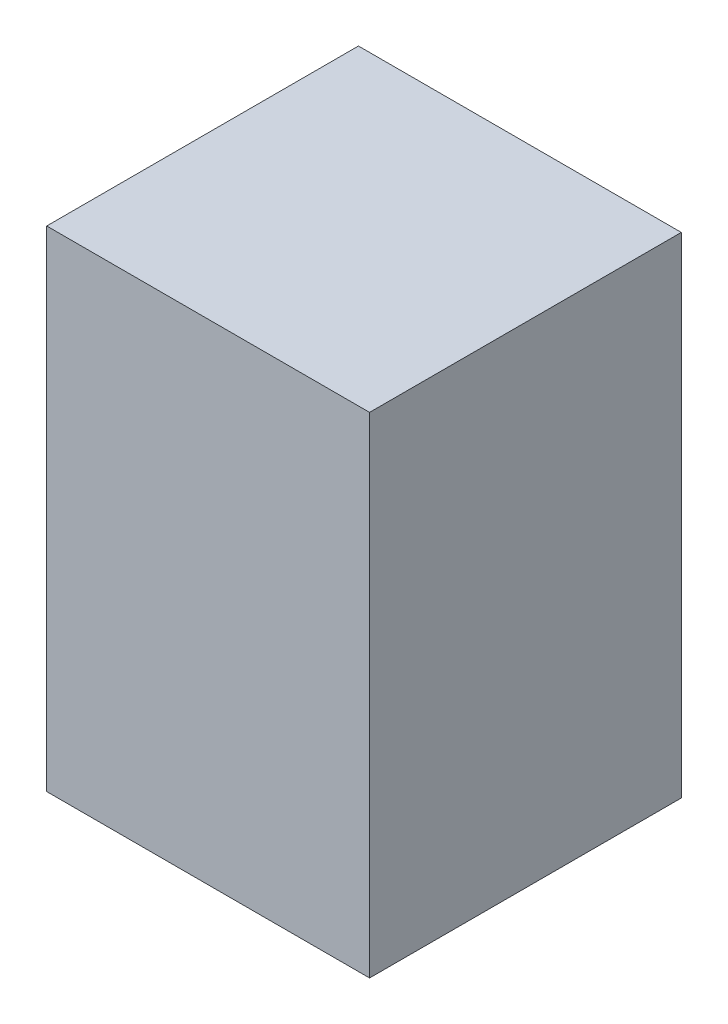
ISO-10303-21;
HEADER;
FILE_DESCRIPTION(('STEP AP214'),'2;1');
FILE_NAME('part.step','',(''),(''),'','','');
FILE_SCHEMA(('AUTOMOTIVE_DESIGN { 1 0 10303 214 1 1 1 1 }'));
ENDSEC;
DATA;
#1=APPLICATION_CONTEXT('core data for automotive mechanical design processes');
#2=APPLICATION_PROTOCOL_DEFINITION('international standard','automotive_design',2000,#1);
#3=PRODUCT_CONTEXT('',#1,'mechanical');
#4=PRODUCT('Part','Part','',(#3));
#5=PRODUCT_RELATED_PRODUCT_CATEGORY('part','',(#4));
#6=PRODUCT_DEFINITION_FORMATION('','',#4);
#7=PRODUCT_DEFINITION_CONTEXT('part definition',#1,'design');
#8=PRODUCT_DEFINITION('design','',#6,#7);
#9=PRODUCT_DEFINITION_SHAPE('','',#8);
#10=(LENGTH_UNIT() NAMED_UNIT(*) SI_UNIT(.MILLI.,.METRE.));
#11=(NAMED_UNIT(*) PLANE_ANGLE_UNIT() SI_UNIT($,.RADIAN.));
#12=(NAMED_UNIT(*) SI_UNIT($,.STERADIAN.) SOLID_ANGLE_UNIT());
#13=UNCERTAINTY_MEASURE_WITH_UNIT(LENGTH_MEASURE(1.E-05),#10,'distance_accuracy_value','');
#14=(GEOMETRIC_REPRESENTATION_CONTEXT(3) GLOBAL_UNCERTAINTY_ASSIGNED_CONTEXT((#13)) GLOBAL_UNIT_ASSIGNED_CONTEXT((#10,
#11,#12)) REPRESENTATION_CONTEXT('',''));
#15=CARTESIAN_POINT('',(0.,0.,0.));
#16=DIRECTION('',(0.,0.,1.));
#17=DIRECTION('',(1.,0.,0.));
#18=AXIS2_PLACEMENT_3D('',#15,#16,#17);
#19=CARTESIAN_POINT('',(-0.72499982,1.10000034,1.39999974));
#20=DIRECTION('',(0.,0.,-1.));
#21=DIRECTION('',(-1.,0.,0.));
#22=AXIS2_PLACEMENT_3D('',#19,#20,#21);
#23=PLANE('',#22);
#24=DIRECTION('',(1.,0.,0.));
#25=VECTOR('',#24,1.);
#26=CARTESIAN_POINT('',(-0.72499982,-1.10000034,1.39999974));
#27=LINE('',#26,#25);
#28=CARTESIAN_POINT('',(-0.72499982,-1.10000034,1.39999974));
#29=VERTEX_POINT('',#28);
#30=CARTESIAN_POINT('',(0.72499982,-1.10000034,1.39999974));
#31=VERTEX_POINT('',#30);
#32=EDGE_CURVE('E55',#29,#31,#27,.T.);
#33=ORIENTED_EDGE('',*,*,#32,.T.);
#34=DIRECTION('',(0.,1.,0.));
#35=VECTOR('',#34,1.);
#36=CARTESIAN_POINT('',(0.72499982,-1.10000034,1.39999974));
#37=LINE('',#36,#35);
#38=CARTESIAN_POINT('',(0.72499982,1.10000034,1.39999974));
#39=VERTEX_POINT('',#38);
#40=EDGE_CURVE('E57',#31,#39,#37,.T.);
#41=ORIENTED_EDGE('',*,*,#40,.T.);
#42=DIRECTION('',(1.,0.,0.));
#43=VECTOR('',#42,1.);
#44=CARTESIAN_POINT('',(0.72499982,1.10000034,1.39999974));
#45=LINE('',#44,#43);
#46=CARTESIAN_POINT('',(-0.72499982,1.10000034,1.39999974));
#47=VERTEX_POINT('',#46);
#48=EDGE_CURVE('E20',#39,#47,#45,.F.);
#49=ORIENTED_EDGE('',*,*,#48,.T.);
#50=DIRECTION('',(0.,1.,0.));
#51=VECTOR('',#50,1.);
#52=CARTESIAN_POINT('',(-0.72499982,1.10000034,1.39999974));
#53=LINE('',#52,#51);
#54=EDGE_CURVE('E80',#47,#29,#53,.F.);
#55=ORIENTED_EDGE('',*,*,#54,.T.);
#56=EDGE_LOOP('',(#33,#41,#49,#55));
#57=FACE_BOUND('',#56,.T.);
#58=ADVANCED_FACE('F17',(#57),#23,.F.);
#59=CARTESIAN_POINT('',(0.72499982,1.10000034,0.));
#60=DIRECTION('',(0.,-1.,0.));
#61=DIRECTION('',(0.,0.,-1.));
#62=AXIS2_PLACEMENT_3D('',#59,#60,#61);
#63=PLANE('',#62);
#64=DIRECTION('',(0.,0.,-1.));
#65=VECTOR('',#64,1.);
#66=CARTESIAN_POINT('',(-0.72499982,1.10000034,0.));
#67=LINE('',#66,#65);
#68=CARTESIAN_POINT('',(-0.72499982,1.10000034,0.));
#69=VERTEX_POINT('',#68);
#70=EDGE_CURVE('E68',#69,#47,#67,.F.);
#71=ORIENTED_EDGE('',*,*,#70,.T.);
#72=ORIENTED_EDGE('',*,*,#48,.F.);
#73=DIRECTION('',(0.,0.,1.));
#74=VECTOR('',#73,1.);
#75=CARTESIAN_POINT('',(0.72499982,1.10000034,0.));
#76=LINE('',#75,#74);
#77=CARTESIAN_POINT('',(0.72499982,1.10000034,0.));
#78=VERTEX_POINT('',#77);
#79=EDGE_CURVE('E63',#39,#78,#76,.F.);
#80=ORIENTED_EDGE('',*,*,#79,.T.);
#81=DIRECTION('',(-1.,0.,0.));
#82=VECTOR('',#81,1.);
#83=CARTESIAN_POINT('',(-0.72499982,1.10000034,0.));
#84=LINE('',#83,#82);
#85=EDGE_CURVE('E83',#69,#78,#84,.F.);
#86=ORIENTED_EDGE('',*,*,#85,.F.);
#87=EDGE_LOOP('',(#71,#72,#80,#86));
#88=FACE_BOUND('',#87,.T.);
#89=ADVANCED_FACE('F65',(#88),#63,.F.);
#90=CARTESIAN_POINT('',(0.72499982,-1.10000034,0.));
#91=DIRECTION('',(-1.,0.,0.));
#92=DIRECTION('',(0.,0.,1.));
#93=AXIS2_PLACEMENT_3D('',#90,#91,#92);
#94=PLANE('',#93);
#95=ORIENTED_EDGE('',*,*,#79,.F.);
#96=ORIENTED_EDGE('',*,*,#40,.F.);
#97=DIRECTION('',(0.,0.,1.));
#98=VECTOR('',#97,1.);
#99=CARTESIAN_POINT('',(0.72499982,-1.10000034,0.));
#100=LINE('',#99,#98);
#101=CARTESIAN_POINT('',(0.72499982,-1.10000034,0.));
#102=VERTEX_POINT('',#101);
#103=EDGE_CURVE('E75',#31,#102,#100,.F.);
#104=ORIENTED_EDGE('',*,*,#103,.T.);
#105=DIRECTION('',(0.,1.,0.));
#106=VECTOR('',#105,1.);
#107=CARTESIAN_POINT('',(0.72499982,1.10000034,0.));
#108=LINE('',#107,#106);
#109=EDGE_CURVE('E72',#78,#102,#108,.F.);
#110=ORIENTED_EDGE('',*,*,#109,.F.);
#111=EDGE_LOOP('',(#95,#96,#104,#110));
#112=FACE_BOUND('',#111,.T.);
#113=ADVANCED_FACE('F70',(#112),#94,.F.);
#114=CARTESIAN_POINT('',(-0.72499982,-1.10000034,0.));
#115=DIRECTION('',(0.,1.,0.));
#116=DIRECTION('',(0.,0.,1.));
#117=AXIS2_PLACEMENT_3D('',#114,#115,#116);
#118=PLANE('',#117);
#119=ORIENTED_EDGE('',*,*,#103,.F.);
#120=ORIENTED_EDGE('',*,*,#32,.F.);
#121=DIRECTION('',(0.,0.,-1.));
#122=VECTOR('',#121,1.);
#123=CARTESIAN_POINT('',(-0.72499982,-1.10000034,0.));
#124=LINE('',#123,#122);
#125=CARTESIAN_POINT('',(-0.72499982,-1.10000034,0.));
#126=VERTEX_POINT('',#125);
#127=EDGE_CURVE('E35',#29,#126,#124,.T.);
#128=ORIENTED_EDGE('',*,*,#127,.T.);
#129=DIRECTION('',(-1.,0.,0.));
#130=VECTOR('',#129,1.);
#131=CARTESIAN_POINT('',(-0.72499982,-1.10000034,0.));
#132=LINE('',#131,#130);
#133=EDGE_CURVE('E26',#102,#126,#132,.T.);
#134=ORIENTED_EDGE('',*,*,#133,.F.);
#135=EDGE_LOOP('',(#119,#120,#128,#134));
#136=FACE_BOUND('',#135,.T.);
#137=ADVANCED_FACE('F89',(#136),#118,.F.);
#138=CARTESIAN_POINT('',(-0.72499982,1.10000034,0.));
#139=DIRECTION('',(1.,0.,0.));
#140=DIRECTION('',(0.,0.,-1.));
#141=AXIS2_PLACEMENT_3D('',#138,#139,#140);
#142=PLANE('',#141);
#143=ORIENTED_EDGE('',*,*,#127,.F.);
#144=ORIENTED_EDGE('',*,*,#54,.F.);
#145=ORIENTED_EDGE('',*,*,#70,.F.);
#146=DIRECTION('',(0.,1.,0.));
#147=VECTOR('',#146,1.);
#148=CARTESIAN_POINT('',(-0.72499982,1.10000034,0.));
#149=LINE('',#148,#147);
#150=EDGE_CURVE('E11',#126,#69,#149,.T.);
#151=ORIENTED_EDGE('',*,*,#150,.F.);
#152=EDGE_LOOP('',(#143,#144,#145,#151));
#153=FACE_BOUND('',#152,.T.);
#154=ADVANCED_FACE('F91',(#153),#142,.F.);
#155=CARTESIAN_POINT('',(-0.72499982,1.10000034,0.));
#156=DIRECTION('',(0.,0.,-1.));
#157=DIRECTION('',(-1.,0.,0.));
#158=AXIS2_PLACEMENT_3D('',#155,#156,#157);
#159=PLANE('',#158);
#160=ORIENTED_EDGE('',*,*,#133,.T.);
#161=ORIENTED_EDGE('',*,*,#150,.T.);
#162=ORIENTED_EDGE('',*,*,#85,.T.);
#163=ORIENTED_EDGE('',*,*,#109,.T.);
#164=EDGE_LOOP('',(#160,#161,#162,#163));
#165=FACE_BOUND('',#164,.T.);
#166=ADVANCED_FACE('F88',(#165),#159,.T.);
#167=CLOSED_SHELL('',(#58,#89,#113,#137,#154,#166));
#168=MANIFOLD_SOLID_BREP('B1',#167);
#169=ADVANCED_BREP_SHAPE_REPRESENTATION('',(#18,#168),#14);
#170=SHAPE_DEFINITION_REPRESENTATION(#9,#169);
ENDSEC;
END-ISO-10303-21;
